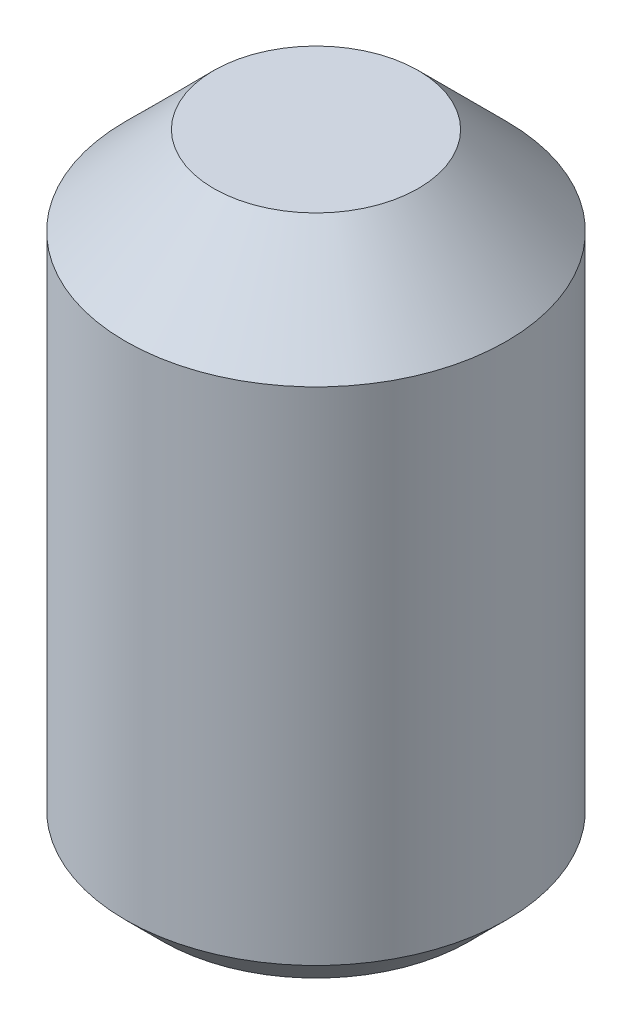
ISO-10303-21;
HEADER;
FILE_DESCRIPTION(('STEP AP214'),'2;1');
FILE_NAME('part.step','',(''),(''),'','','');
FILE_SCHEMA(('AUTOMOTIVE_DESIGN { 1 0 10303 214 1 1 1 1 }'));
ENDSEC;
DATA;
#1=APPLICATION_CONTEXT('core data for automotive mechanical design processes');
#2=APPLICATION_PROTOCOL_DEFINITION('international standard','automotive_design',2000,#1);
#3=PRODUCT_CONTEXT('',#1,'mechanical');
#4=PRODUCT('Part','Part','',(#3));
#5=PRODUCT_RELATED_PRODUCT_CATEGORY('part','',(#4));
#6=PRODUCT_DEFINITION_FORMATION('','',#4);
#7=PRODUCT_DEFINITION_CONTEXT('part definition',#1,'design');
#8=PRODUCT_DEFINITION('design','',#6,#7);
#9=PRODUCT_DEFINITION_SHAPE('','',#8);
#10=(LENGTH_UNIT() NAMED_UNIT(*) SI_UNIT(.MILLI.,.METRE.));
#11=(NAMED_UNIT(*) PLANE_ANGLE_UNIT() SI_UNIT($,.RADIAN.));
#12=(NAMED_UNIT(*) SI_UNIT($,.STERADIAN.) SOLID_ANGLE_UNIT());
#13=UNCERTAINTY_MEASURE_WITH_UNIT(LENGTH_MEASURE(1.E-05),#10,'distance_accuracy_value','');
#14=(GEOMETRIC_REPRESENTATION_CONTEXT(3) GLOBAL_UNCERTAINTY_ASSIGNED_CONTEXT((#13)) GLOBAL_UNIT_ASSIGNED_CONTEXT((#10,
#11,#12)) REPRESENTATION_CONTEXT('',''));
#15=CARTESIAN_POINT('',(0.,0.,0.));
#16=DIRECTION('',(0.,0.,1.));
#17=DIRECTION('',(1.,0.,0.));
#18=AXIS2_PLACEMENT_3D('',#15,#16,#17);
#19=CARTESIAN_POINT('',(1.37408158,0.,0.));
#20=DIRECTION('',(0.866025403784439,0.,0.5));
#21=DIRECTION('',(0.5,0.,-0.866025403784439));
#22=AXIS2_PLACEMENT_3D('',#19,#20,#21);
#23=PLANE('',#22);
#24=DIRECTION('',(0.5,0.,-0.866025403784439));
#25=VECTOR('',#24,1.);
#26=CARTESIAN_POINT('',(1.37408158,2.54,0.));
#27=LINE('',#26,#25);
#28=CARTESIAN_POINT('',(1.37408158,2.54,0.));
#29=VERTEX_POINT('',#28);
#30=CARTESIAN_POINT('',(0.68704079,2.54,1.18998955515226));
#31=VERTEX_POINT('',#30);
#32=EDGE_CURVE('E63',#29,#31,#27,.F.);
#33=ORIENTED_EDGE('',*,*,#32,.F.);
#34=DIRECTION('',(0.,1.,0.));
#35=VECTOR('',#34,1.);
#36=CARTESIAN_POINT('',(1.37408158,0.,0.));
#37=LINE('',#36,#35);
#38=CARTESIAN_POINT('',(1.37408158,0.,0.));
#39=VERTEX_POINT('',#38);
#40=EDGE_CURVE('E83',#29,#39,#37,.F.);
#41=ORIENTED_EDGE('',*,*,#40,.T.);
#42=DIRECTION('',(0.5,0.,-0.866025403784439));
#43=VECTOR('',#42,1.);
#44=CARTESIAN_POINT('',(1.37408158,0.,0.));
#45=LINE('',#44,#43);
#46=CARTESIAN_POINT('',(0.68704079,0.,1.18998955515226));
#47=VERTEX_POINT('',#46);
#48=EDGE_CURVE('E72',#47,#39,#45,.T.);
#49=ORIENTED_EDGE('',*,*,#48,.F.);
#50=DIRECTION('',(0.,1.,0.));
#51=VECTOR('',#50,1.);
#52=CARTESIAN_POINT('',(0.68704079,0.,1.18998955515226));
#53=LINE('',#52,#51);
#54=EDGE_CURVE('E78',#47,#31,#53,.T.);
#55=ORIENTED_EDGE('',*,*,#54,.T.);
#56=EDGE_LOOP('',(#33,#41,#49,#55));
#57=FACE_BOUND('',#56,.T.);
#58=ADVANCED_FACE('F15',(#57),#23,.F.);
#59=CARTESIAN_POINT('',(0.68704079,0.,1.18998955515226));
#60=DIRECTION('',(0.,0.,1.));
#61=DIRECTION('',(1.,0.,0.));
#62=AXIS2_PLACEMENT_3D('',#59,#60,#61);
#63=PLANE('',#62);
#64=DIRECTION('',(1.,0.,0.));
#65=VECTOR('',#64,1.);
#66=CARTESIAN_POINT('',(0.68704079,2.54,1.18998955515226));
#67=LINE('',#66,#65);
#68=CARTESIAN_POINT('',(-0.68704079,2.54,1.18998955515226));
#69=VERTEX_POINT('',#68);
#70=EDGE_CURVE('E87',#31,#69,#67,.F.);
#71=ORIENTED_EDGE('',*,*,#70,.F.);
#72=ORIENTED_EDGE('',*,*,#54,.F.);
#73=DIRECTION('',(1.,0.,0.));
#74=VECTOR('',#73,1.);
#75=CARTESIAN_POINT('',(0.68704079,0.,1.18998955515226));
#76=LINE('',#75,#74);
#77=CARTESIAN_POINT('',(-0.68704079,0.,1.18998955515226));
#78=VERTEX_POINT('',#77);
#79=EDGE_CURVE('E68',#78,#47,#76,.T.);
#80=ORIENTED_EDGE('',*,*,#79,.F.);
#81=DIRECTION('',(0.,1.,0.));
#82=VECTOR('',#81,1.);
#83=CARTESIAN_POINT('',(-0.68704079,0.,1.18998955515226));
#84=LINE('',#83,#82);
#85=EDGE_CURVE('E128',#78,#69,#84,.T.);
#86=ORIENTED_EDGE('',*,*,#85,.T.);
#87=EDGE_LOOP('',(#71,#72,#80,#86));
#88=FACE_BOUND('',#87,.T.);
#89=ADVANCED_FACE('F86',(#88),#63,.F.);
#90=CARTESIAN_POINT('',(0.68704079,0.,-1.18998955515226));
#91=DIRECTION('',(0.866025403784439,0.,-0.5));
#92=DIRECTION('',(-0.5,0.,-0.866025403784439));
#93=AXIS2_PLACEMENT_3D('',#90,#91,#92);
#94=PLANE('',#93);
#95=DIRECTION('',(0.5,0.,0.866025403784438));
#96=VECTOR('',#95,1.);
#97=CARTESIAN_POINT('',(0.68704079,2.54,-1.18998955515226));
#98=LINE('',#97,#96);
#99=CARTESIAN_POINT('',(0.68704079,2.54,-1.18998955515226));
#100=VERTEX_POINT('',#99);
#101=EDGE_CURVE('E126',#100,#29,#98,.T.);
#102=ORIENTED_EDGE('',*,*,#101,.F.);
#103=DIRECTION('',(0.,1.,0.));
#104=VECTOR('',#103,1.);
#105=CARTESIAN_POINT('',(0.68704079,0.,-1.18998955515226));
#106=LINE('',#105,#104);
#107=CARTESIAN_POINT('',(0.68704079,0.,-1.18998955515226));
#108=VERTEX_POINT('',#107);
#109=EDGE_CURVE('E114',#100,#108,#106,.F.);
#110=ORIENTED_EDGE('',*,*,#109,.T.);
#111=DIRECTION('',(-0.5,0.,-0.866025403784439));
#112=VECTOR('',#111,1.);
#113=CARTESIAN_POINT('',(0.68704079,0.,-1.18998955515226));
#114=LINE('',#113,#112);
#115=EDGE_CURVE('E89',#39,#108,#114,.T.);
#116=ORIENTED_EDGE('',*,*,#115,.F.);
#117=ORIENTED_EDGE('',*,*,#40,.F.);
#118=EDGE_LOOP('',(#102,#110,#116,#117));
#119=FACE_BOUND('',#118,.T.);
#120=ADVANCED_FACE('F134',(#119),#94,.F.);
#121=CARTESIAN_POINT('',(-0.68704079,0.,1.18998955515226));
#122=DIRECTION('',(-0.866025403784439,0.,0.5));
#123=DIRECTION('',(0.5,0.,0.866025403784439));
#124=AXIS2_PLACEMENT_3D('',#121,#122,#123);
#125=PLANE('',#124);
#126=DIRECTION('',(-0.5,0.,-0.866025403784438));
#127=VECTOR('',#126,1.);
#128=CARTESIAN_POINT('',(-0.68704079,2.54,1.18998955515226));
#129=LINE('',#128,#127);
#130=CARTESIAN_POINT('',(-1.37408158,2.54,0.));
#131=VERTEX_POINT('',#130);
#132=EDGE_CURVE('E123',#69,#131,#129,.T.);
#133=ORIENTED_EDGE('',*,*,#132,.F.);
#134=ORIENTED_EDGE('',*,*,#85,.F.);
#135=DIRECTION('',(0.5,0.,0.866025403784439));
#136=VECTOR('',#135,1.);
#137=CARTESIAN_POINT('',(-0.68704079,0.,1.18998955515226));
#138=LINE('',#137,#136);
#139=CARTESIAN_POINT('',(-1.37408158,0.,0.));
#140=VERTEX_POINT('',#139);
#141=EDGE_CURVE('E33',#140,#78,#138,.T.);
#142=ORIENTED_EDGE('',*,*,#141,.F.);
#143=DIRECTION('',(0.,1.,0.));
#144=VECTOR('',#143,1.);
#145=CARTESIAN_POINT('',(-1.37408158,0.,0.));
#146=LINE('',#145,#144);
#147=EDGE_CURVE('E113',#140,#131,#146,.T.);
#148=ORIENTED_EDGE('',*,*,#147,.T.);
#149=EDGE_LOOP('',(#133,#134,#142,#148));
#150=FACE_BOUND('',#149,.T.);
#151=ADVANCED_FACE('F142',(#150),#125,.F.);
#152=CARTESIAN_POINT('',(0.,2.54,0.));
#153=DIRECTION('',(0.,-1.,0.));
#154=DIRECTION('',(0.,0.,-1.));
#155=AXIS2_PLACEMENT_3D('',#152,#153,#154);
#156=PLANE('',#155);
#157=DIRECTION('',(-0.5,0.,0.866025403784439));
#158=VECTOR('',#157,1.);
#159=CARTESIAN_POINT('',(-1.37408158,2.54,0.));
#160=LINE('',#159,#158);
#161=CARTESIAN_POINT('',(-0.68704079,2.54,-1.18998955515226));
#162=VERTEX_POINT('',#161);
#163=EDGE_CURVE('E109',#131,#162,#160,.F.);
#164=ORIENTED_EDGE('',*,*,#163,.T.);
#165=DIRECTION('',(-1.,0.,0.));
#166=VECTOR('',#165,1.);
#167=CARTESIAN_POINT('',(-0.68704079,2.54,-1.18998955515226));
#168=LINE('',#167,#166);
#169=EDGE_CURVE('E118',#162,#100,#168,.F.);
#170=ORIENTED_EDGE('',*,*,#169,.T.);
#171=ORIENTED_EDGE('',*,*,#101,.T.);
#172=ORIENTED_EDGE('',*,*,#32,.T.);
#173=ORIENTED_EDGE('',*,*,#70,.T.);
#174=ORIENTED_EDGE('',*,*,#132,.T.);
#175=EDGE_LOOP('',(#164,#170,#171,#172,#173,#174));
#176=FACE_BOUND('',#175,.T.);
#177=ADVANCED_FACE('F140',(#176),#156,.T.);
#178=CARTESIAN_POINT('',(-0.68704079,0.,-1.18998955515226));
#179=DIRECTION('',(0.,0.,-1.));
#180=DIRECTION('',(-1.,0.,0.));
#181=AXIS2_PLACEMENT_3D('',#178,#179,#180);
#182=PLANE('',#181);
#183=ORIENTED_EDGE('',*,*,#169,.F.);
#184=DIRECTION('',(0.,1.,0.));
#185=VECTOR('',#184,1.);
#186=CARTESIAN_POINT('',(-0.68704079,0.,-1.18998955515226));
#187=LINE('',#186,#185);
#188=CARTESIAN_POINT('',(-0.68704079,0.,-1.18998955515226));
#189=VERTEX_POINT('',#188);
#190=EDGE_CURVE('E104',#162,#189,#187,.F.);
#191=ORIENTED_EDGE('',*,*,#190,.T.);
#192=DIRECTION('',(-1.,0.,0.));
#193=VECTOR('',#192,1.);
#194=CARTESIAN_POINT('',(-0.68704079,0.,-1.18998955515226));
#195=LINE('',#194,#193);
#196=EDGE_CURVE('E121',#108,#189,#195,.T.);
#197=ORIENTED_EDGE('',*,*,#196,.F.);
#198=ORIENTED_EDGE('',*,*,#109,.F.);
#199=EDGE_LOOP('',(#183,#191,#197,#198));
#200=FACE_BOUND('',#199,.T.);
#201=ADVANCED_FACE('F137',(#200),#182,.F.);
#202=CARTESIAN_POINT('',(-1.37408158,0.,0.));
#203=DIRECTION('',(-0.866025403784439,0.,-0.5));
#204=DIRECTION('',(-0.5,0.,0.866025403784439));
#205=AXIS2_PLACEMENT_3D('',#202,#203,#204);
#206=PLANE('',#205);
#207=ORIENTED_EDGE('',*,*,#163,.F.);
#208=ORIENTED_EDGE('',*,*,#147,.F.);
#209=DIRECTION('',(0.5,0.,-0.866025403784439));
#210=VECTOR('',#209,1.);
#211=CARTESIAN_POINT('',(-1.37408158,0.,0.));
#212=LINE('',#211,#210);
#213=EDGE_CURVE('E100',#140,#189,#212,.T.);
#214=ORIENTED_EDGE('',*,*,#213,.T.);
#215=ORIENTED_EDGE('',*,*,#190,.F.);
#216=EDGE_LOOP('',(#207,#208,#214,#215));
#217=FACE_BOUND('',#216,.T.);
#218=ADVANCED_FACE('F139',(#217),#206,.F.);
#219=CARTESIAN_POINT('',(0.,7.9375,0.));
#220=DIRECTION('',(0.,1.,0.));
#221=DIRECTION('',(0.,0.,1.));
#222=AXIS2_PLACEMENT_3D('',#219,#220,#221);
#223=PLANE('',#222);
#224=CARTESIAN_POINT('',(0.,7.93750000002547,0.));
#225=DIRECTION('',(0.,-1.,0.));
#226=DIRECTION('',(0.,0.,-1.));
#227=AXIS2_PLACEMENT_3D('',#224,#225,#226);
#228=CIRCLE('',#227,1.29540000000361);
#229=CARTESIAN_POINT('',(0.,7.93750000002547,-1.29540000000361));
#230=VERTEX_POINT('',#229);
#231=EDGE_CURVE('E18',#230,#230,#228,.T.);
#232=ORIENTED_EDGE('',*,*,#231,.F.);
#233=EDGE_LOOP('',(#232));
#234=FACE_BOUND('',#233,.T.);
#235=ADVANCED_FACE('F170',(#234),#223,.T.);
#236=CARTESIAN_POINT('',(0.,0.,0.));
#237=DIRECTION('',(0.,1.,0.));
#238=DIRECTION('',(0.,0.,1.));
#239=AXIS2_PLACEMENT_3D('',#236,#237,#238);
#240=PLANE('',#239);
#241=ORIENTED_EDGE('',*,*,#141,.T.);
#242=ORIENTED_EDGE('',*,*,#79,.T.);
#243=ORIENTED_EDGE('',*,*,#48,.T.);
#244=ORIENTED_EDGE('',*,*,#115,.T.);
#245=ORIENTED_EDGE('',*,*,#196,.T.);
#246=ORIENTED_EDGE('',*,*,#213,.F.);
#247=EDGE_LOOP('',(#241,#242,#243,#244,#245,#246));
#248=FACE_BOUND('',#247,.T.);
#249=CARTESIAN_POINT('',(0.,0.,0.));
#250=DIRECTION('',(0.,1.,0.));
#251=DIRECTION('',(0.,0.,1.));
#252=AXIS2_PLACEMENT_3D('',#249,#250,#251);
#253=CIRCLE('',#252,1.94056000003684);
#254=CARTESIAN_POINT('',(0.,0.,1.94056000003684));
#255=VERTEX_POINT('',#254);
#256=EDGE_CURVE('E93',#255,#255,#253,.T.);
#257=ORIENTED_EDGE('',*,*,#256,.F.);
#258=EDGE_LOOP('',(#257));
#259=FACE_BOUND('',#258,.T.);
#260=ADVANCED_FACE('F70',(#248,#259),#240,.F.);
#261=CARTESIAN_POINT('',(0.,6.81989999998223,0.));
#262=DIRECTION('',(0.,-1.,0.));
#263=DIRECTION('',(0.,0.,-1.));
#264=AXIS2_PLACEMENT_3D('',#261,#262,#263);
#265=CONICAL_SURFACE('',#264,2.41299999999001,0.785398163372017);
#266=CARTESIAN_POINT('',(0.,6.8199,0.));
#267=DIRECTION('',(0.,1.,0.));
#268=DIRECTION('',(0.,0.,1.));
#269=AXIS2_PLACEMENT_3D('',#266,#267,#268);
#270=CIRCLE('',#269,2.413);
#271=CARTESIAN_POINT('',(0.,6.8199,2.413));
#272=VERTEX_POINT('',#271);
#273=EDGE_CURVE('E24',#272,#272,#270,.F.);
#274=ORIENTED_EDGE('',*,*,#273,.F.);
#275=EDGE_LOOP('',(#274));
#276=FACE_BOUND('',#275,.T.);
#277=ORIENTED_EDGE('',*,*,#231,.T.);
#278=EDGE_LOOP('',(#277));
#279=FACE_BOUND('',#278,.T.);
#280=ADVANCED_FACE('F160',(#276,#279),#265,.T.);
#281=CARTESIAN_POINT('',(0.,0.472439999896324,0.));
#282=DIRECTION('',(0.,1.,0.));
#283=DIRECTION('',(0.,0.,1.));
#284=AXIS2_PLACEMENT_3D('',#281,#282,#283);
#285=CONICAL_SURFACE('',#284,2.41299999993316,0.785398163397448);
#286=CARTESIAN_POINT('',(0.,0.47244,0.));
#287=DIRECTION('',(0.,1.,0.));
#288=DIRECTION('',(0.,0.,1.));
#289=AXIS2_PLACEMENT_3D('',#286,#287,#288);
#290=CIRCLE('',#289,2.413);
#291=CARTESIAN_POINT('',(0.,0.47244,2.413));
#292=VERTEX_POINT('',#291);
#293=EDGE_CURVE('E10',#292,#292,#290,.T.);
#294=ORIENTED_EDGE('',*,*,#293,.F.);
#295=EDGE_LOOP('',(#294));
#296=FACE_BOUND('',#295,.T.);
#297=ORIENTED_EDGE('',*,*,#256,.T.);
#298=EDGE_LOOP('',(#297));
#299=FACE_BOUND('',#298,.T.);
#300=ADVANCED_FACE('F154',(#296,#299),#285,.T.);
#301=CARTESIAN_POINT('',(0.,0.,0.));
#302=DIRECTION('',(0.,1.,0.));
#303=DIRECTION('',(0.,0.,1.));
#304=AXIS2_PLACEMENT_3D('',#301,#302,#303);
#305=CYLINDRICAL_SURFACE('',#304,2.413);
#306=ORIENTED_EDGE('',*,*,#273,.T.);
#307=EDGE_LOOP('',(#306));
#308=FACE_BOUND('',#307,.T.);
#309=ORIENTED_EDGE('',*,*,#293,.T.);
#310=EDGE_LOOP('',(#309));
#311=FACE_BOUND('',#310,.T.);
#312=ADVANCED_FACE('F152',(#308,#311),#305,.T.);
#313=CLOSED_SHELL('',(#58,#89,#120,#151,#177,#201,#218,#235,#260,#280,#300,#312));
#314=MANIFOLD_SOLID_BREP('B1',#313);
#315=ADVANCED_BREP_SHAPE_REPRESENTATION('',(#18,#314),#14);
#316=SHAPE_DEFINITION_REPRESENTATION(#9,#315);
ENDSEC;
END-ISO-10303-21;
